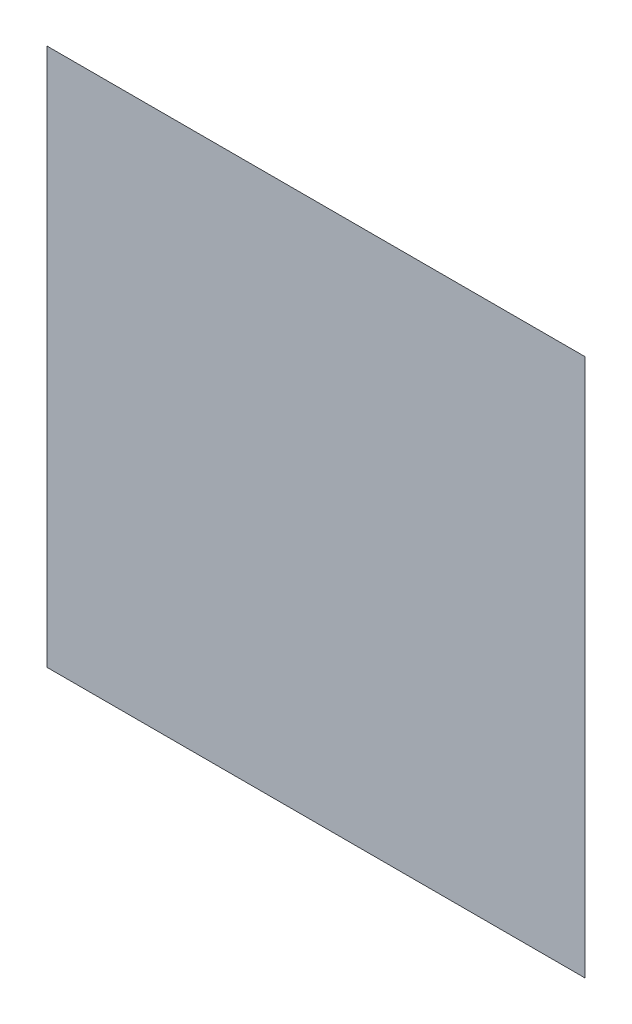
ISO-10303-21;
HEADER;
FILE_DESCRIPTION(('STEP AP214'),'2;1');
FILE_NAME('part.step','',(''),(''),'','','');
FILE_SCHEMA(('AUTOMOTIVE_DESIGN { 1 0 10303 214 1 1 1 1 }'));
ENDSEC;
DATA;
#1=APPLICATION_CONTEXT('core data for automotive mechanical design processes');
#2=APPLICATION_PROTOCOL_DEFINITION('international standard','automotive_design',2000,#1);
#3=PRODUCT_CONTEXT('',#1,'mechanical');
#4=PRODUCT('Part','Part','',(#3));
#5=PRODUCT_RELATED_PRODUCT_CATEGORY('part','',(#4));
#6=PRODUCT_DEFINITION_FORMATION('','',#4);
#7=PRODUCT_DEFINITION_CONTEXT('part definition',#1,'design');
#8=PRODUCT_DEFINITION('design','',#6,#7);
#9=PRODUCT_DEFINITION_SHAPE('','',#8);
#10=(LENGTH_UNIT() NAMED_UNIT(*) SI_UNIT(.MILLI.,.METRE.));
#11=(NAMED_UNIT(*) PLANE_ANGLE_UNIT() SI_UNIT($,.RADIAN.));
#12=(NAMED_UNIT(*) SI_UNIT($,.STERADIAN.) SOLID_ANGLE_UNIT());
#13=UNCERTAINTY_MEASURE_WITH_UNIT(LENGTH_MEASURE(1.E-05),#10,'distance_accuracy_value','');
#14=(GEOMETRIC_REPRESENTATION_CONTEXT(3) GLOBAL_UNCERTAINTY_ASSIGNED_CONTEXT((#13)) GLOBAL_UNIT_ASSIGNED_CONTEXT((#10,
#11,#12)) REPRESENTATION_CONTEXT('',''));
#15=CARTESIAN_POINT('',(0.,0.,0.));
#16=DIRECTION('',(0.,0.,1.));
#17=DIRECTION('',(1.,0.,0.));
#18=AXIS2_PLACEMENT_3D('',#15,#16,#17);
#19=CARTESIAN_POINT('',(0.,0.,0.));
#20=DIRECTION('',(0.,0.,1.));
#21=DIRECTION('',(1.,0.,0.));
#22=AXIS2_PLACEMENT_3D('',#19,#20,#21);
#23=PLANE('',#22);
#24=DIRECTION('',(0.,-1.,0.));
#25=VECTOR('',#24,1.);
#26=CARTESIAN_POINT('',(-22.2639320225002,12.25,0.));
#27=LINE('',#26,#25);
#28=CARTESIAN_POINT('',(-22.2639320225002,22.2639320225002,0.));
#29=VERTEX_POINT('',#28);
#30=CARTESIAN_POINT('',(-22.2639320225002,-22.2639320225002,0.));
#31=VERTEX_POINT('',#30);
#32=EDGE_CURVE('E66',#29,#31,#27,.T.);
#33=ORIENTED_EDGE('',*,*,#32,.F.);
#34=DIRECTION('',(-1.,0.,0.));
#35=VECTOR('',#34,1.);
#36=CARTESIAN_POINT('',(12.25,22.2639320225002,0.));
#37=LINE('',#36,#35);
#38=CARTESIAN_POINT('',(22.2639320225002,22.2639320225002,0.));
#39=VERTEX_POINT('',#38);
#40=EDGE_CURVE('E62',#39,#29,#37,.T.);
#41=ORIENTED_EDGE('',*,*,#40,.F.);
#42=DIRECTION('',(0.,1.,0.));
#43=VECTOR('',#42,1.);
#44=CARTESIAN_POINT('',(22.2639320225002,-12.25,0.));
#45=LINE('',#44,#43);
#46=CARTESIAN_POINT('',(22.2639320225002,-22.2639320225002,0.));
#47=VERTEX_POINT('',#46);
#48=EDGE_CURVE('E65',#47,#39,#45,.T.);
#49=ORIENTED_EDGE('',*,*,#48,.F.);
#50=DIRECTION('',(1.,0.,0.));
#51=VECTOR('',#50,1.);
#52=CARTESIAN_POINT('',(-12.25,-22.2639320225002,0.));
#53=LINE('',#52,#51);
#54=EDGE_CURVE('E74',#31,#47,#53,.T.);
#55=ORIENTED_EDGE('',*,*,#54,.F.);
#56=EDGE_LOOP('',(#33,#41,#49,#55));
#57=FACE_BOUND('',#56,.T.);
#58=ADVANCED_FACE('F16',(#57),#23,.F.);
#59=CARTESIAN_POINT('',(12.25,22.2639320225002,3.));
#60=DIRECTION('',(-1.,0.,0.));
#61=DIRECTION('',(0.,-1.,0.));
#62=AXIS2_PLACEMENT_3D('',#59,#60,#61);
#63=CYLINDRICAL_SURFACE('',#62,3.);
#64=CARTESIAN_POINT('',(-22.2639320225002,22.2639320225002,3.));
#65=DIRECTION('',(-0.707106781186548,-0.707106781186547,0.));
#66=DIRECTION('',(0.707106781186547,-0.707106781186547,0.));
#67=AXIS2_PLACEMENT_3D('',#64,#65,#66);
#68=ELLIPSE('',#67,4.24264068711929,3.);
#69=CARTESIAN_POINT('',(-24.5,24.5,1.));
#70=VERTEX_POINT('',#69);
#71=EDGE_CURVE('E19',#70,#29,#68,.T.);
#72=ORIENTED_EDGE('',*,*,#71,.F.);
#73=DIRECTION('',(1.,0.,0.));
#74=VECTOR('',#73,1.);
#75=CARTESIAN_POINT('',(0.,24.5,1.));
#76=LINE('',#75,#74);
#77=CARTESIAN_POINT('',(24.5,24.5,1.));
#78=VERTEX_POINT('',#77);
#79=EDGE_CURVE('E56',#78,#70,#76,.F.);
#80=ORIENTED_EDGE('',*,*,#79,.F.);
#81=CARTESIAN_POINT('',(22.2639320225002,22.2639320225002,3.));
#82=DIRECTION('',(-0.707106781186547,0.707106781186548,0.));
#83=DIRECTION('',(0.707106781186548,0.707106781186547,0.));
#84=AXIS2_PLACEMENT_3D('',#81,#82,#83);
#85=ELLIPSE('',#84,4.24264068711929,3.);
#86=EDGE_CURVE('E68',#39,#78,#85,.F.);
#87=ORIENTED_EDGE('',*,*,#86,.F.);
#88=ORIENTED_EDGE('',*,*,#40,.T.);
#89=EDGE_LOOP('',(#72,#80,#87,#88));
#90=FACE_BOUND('',#89,.T.);
#91=ADVANCED_FACE('F69',(#90),#63,.T.);
#92=CARTESIAN_POINT('',(-22.2639320225002,12.25,3.));
#93=DIRECTION('',(0.,-1.,0.));
#94=DIRECTION('',(0.,0.,-1.));
#95=AXIS2_PLACEMENT_3D('',#92,#93,#94);
#96=CYLINDRICAL_SURFACE('',#95,3.);
#97=ORIENTED_EDGE('',*,*,#71,.T.);
#98=ORIENTED_EDGE('',*,*,#32,.T.);
#99=CARTESIAN_POINT('',(-22.2639320225002,-22.2639320225002,3.));
#100=DIRECTION('',(0.707106781186547,-0.707106781186547,0.));
#101=DIRECTION('',(0.707106781186547,0.707106781186547,0.));
#102=AXIS2_PLACEMENT_3D('',#99,#100,#101);
#103=ELLIPSE('',#102,4.24264068711929,3.);
#104=CARTESIAN_POINT('',(-24.5,-24.5,1.));
#105=VERTEX_POINT('',#104);
#106=EDGE_CURVE('E82',#105,#31,#103,.T.);
#107=ORIENTED_EDGE('',*,*,#106,.F.);
#108=DIRECTION('',(0.,1.,0.));
#109=VECTOR('',#108,1.);
#110=CARTESIAN_POINT('',(-24.5,0.,1.));
#111=LINE('',#110,#109);
#112=EDGE_CURVE('E78',#70,#105,#111,.F.);
#113=ORIENTED_EDGE('',*,*,#112,.F.);
#114=EDGE_LOOP('',(#97,#98,#107,#113));
#115=FACE_BOUND('',#114,.T.);
#116=ADVANCED_FACE('F88',(#115),#96,.T.);
#117=CARTESIAN_POINT('',(-12.25,-22.2639320225002,3.));
#118=DIRECTION('',(1.,0.,0.));
#119=DIRECTION('',(0.,0.,-1.));
#120=AXIS2_PLACEMENT_3D('',#117,#118,#119);
#121=CYLINDRICAL_SURFACE('',#120,3.);
#122=CARTESIAN_POINT('',(22.2639320225002,-22.2639320225002,3.));
#123=DIRECTION('',(0.707106781186547,0.707106781186547,0.));
#124=DIRECTION('',(-0.707106781186547,0.707106781186548,0.));
#125=AXIS2_PLACEMENT_3D('',#122,#123,#124);
#126=ELLIPSE('',#125,4.24264068711929,3.);
#127=CARTESIAN_POINT('',(24.5,-24.5,1.));
#128=VERTEX_POINT('',#127);
#129=EDGE_CURVE('E34',#128,#47,#126,.T.);
#130=ORIENTED_EDGE('',*,*,#129,.F.);
#131=DIRECTION('',(1.,0.,0.));
#132=VECTOR('',#131,1.);
#133=CARTESIAN_POINT('',(0.,-24.5,1.));
#134=LINE('',#133,#132);
#135=EDGE_CURVE('E25',#105,#128,#134,.T.);
#136=ORIENTED_EDGE('',*,*,#135,.F.);
#137=ORIENTED_EDGE('',*,*,#106,.T.);
#138=ORIENTED_EDGE('',*,*,#54,.T.);
#139=EDGE_LOOP('',(#130,#136,#137,#138));
#140=FACE_BOUND('',#139,.T.);
#141=ADVANCED_FACE('F86',(#140),#121,.T.);
#142=CARTESIAN_POINT('',(22.2639320225002,-12.25,3.));
#143=DIRECTION('',(0.,1.,0.));
#144=DIRECTION('',(-1.,0.,0.));
#145=AXIS2_PLACEMENT_3D('',#142,#143,#144);
#146=CYLINDRICAL_SURFACE('',#145,3.);
#147=ORIENTED_EDGE('',*,*,#86,.T.);
#148=DIRECTION('',(0.,1.,0.));
#149=VECTOR('',#148,1.);
#150=CARTESIAN_POINT('',(24.5,0.,1.));
#151=LINE('',#150,#149);
#152=EDGE_CURVE('E10',#128,#78,#151,.T.);
#153=ORIENTED_EDGE('',*,*,#152,.F.);
#154=ORIENTED_EDGE('',*,*,#129,.T.);
#155=ORIENTED_EDGE('',*,*,#48,.T.);
#156=EDGE_LOOP('',(#147,#153,#154,#155));
#157=FACE_BOUND('',#156,.T.);
#158=ADVANCED_FACE('F72',(#157),#146,.T.);
#159=CARTESIAN_POINT('',(0.,0.,1.));
#160=DIRECTION('',(0.,0.,1.));
#161=DIRECTION('',(1.,0.,0.));
#162=AXIS2_PLACEMENT_3D('',#159,#160,#161);
#163=PLANE('',#162);
#164=ORIENTED_EDGE('',*,*,#135,.T.);
#165=ORIENTED_EDGE('',*,*,#152,.T.);
#166=ORIENTED_EDGE('',*,*,#79,.T.);
#167=ORIENTED_EDGE('',*,*,#112,.T.);
#168=EDGE_LOOP('',(#164,#165,#166,#167));
#169=FACE_BOUND('',#168,.T.);
#170=ADVANCED_FACE('F90',(#169),#163,.T.);
#171=CLOSED_SHELL('',(#58,#91,#116,#141,#158,#170));
#172=MANIFOLD_SOLID_BREP('B1',#171);
#173=ADVANCED_BREP_SHAPE_REPRESENTATION('',(#18,#172),#14);
#174=SHAPE_DEFINITION_REPRESENTATION(#9,#173);
ENDSEC;
END-ISO-10303-21;
